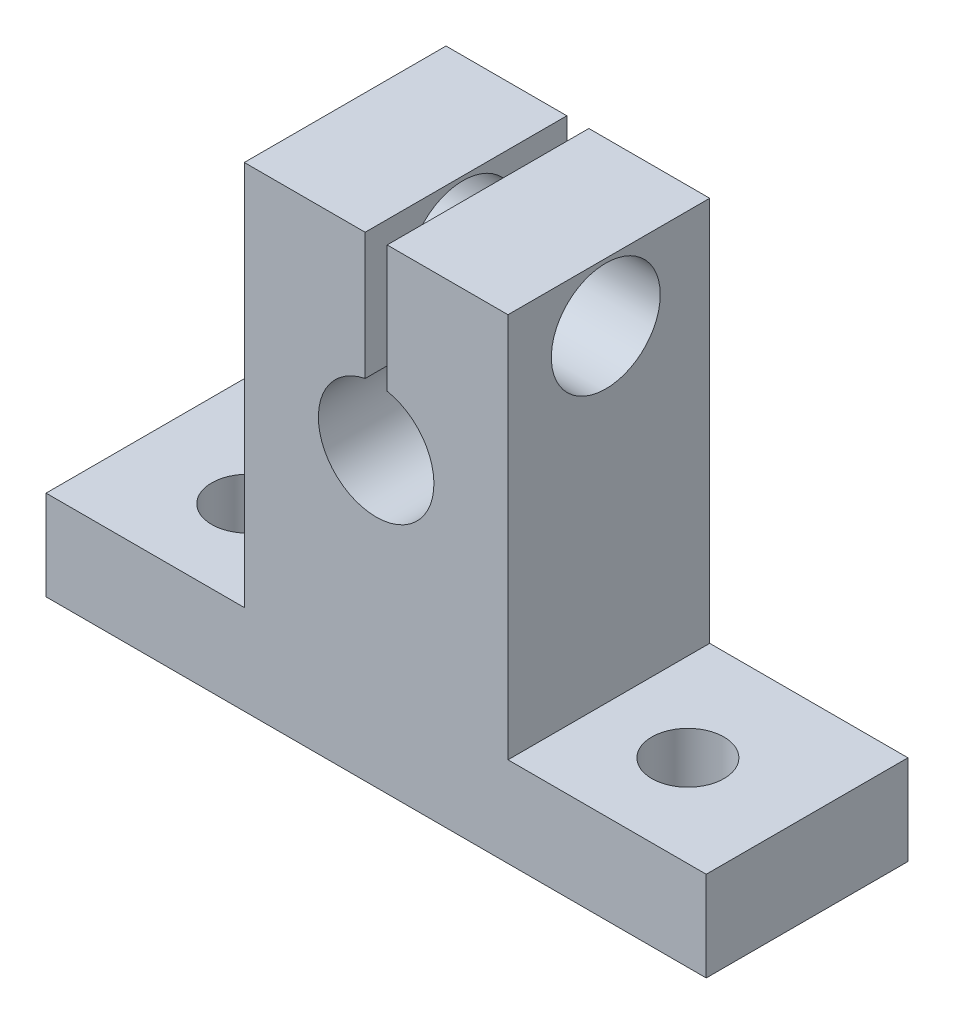
ISO-10303-21;
HEADER;
FILE_DESCRIPTION(('STEP AP214'),'2;1');
FILE_NAME('part.step','',(''),(''),'','','');
FILE_SCHEMA(('AUTOMOTIVE_DESIGN { 1 0 10303 214 1 1 1 1 }'));
ENDSEC;
DATA;
#1=APPLICATION_CONTEXT('core data for automotive mechanical design processes');
#2=APPLICATION_PROTOCOL_DEFINITION('international standard','automotive_design',2000,#1);
#3=PRODUCT_CONTEXT('',#1,'mechanical');
#4=PRODUCT('Part','Part','',(#3));
#5=PRODUCT_RELATED_PRODUCT_CATEGORY('part','',(#4));
#6=PRODUCT_DEFINITION_FORMATION('','',#4);
#7=PRODUCT_DEFINITION_CONTEXT('part definition',#1,'design');
#8=PRODUCT_DEFINITION('design','',#6,#7);
#9=PRODUCT_DEFINITION_SHAPE('','',#8);
#10=(LENGTH_UNIT() NAMED_UNIT(*) SI_UNIT(.MILLI.,.METRE.));
#11=(NAMED_UNIT(*) PLANE_ANGLE_UNIT() SI_UNIT($,.RADIAN.));
#12=(NAMED_UNIT(*) SI_UNIT($,.STERADIAN.) SOLID_ANGLE_UNIT());
#13=UNCERTAINTY_MEASURE_WITH_UNIT(LENGTH_MEASURE(1.E-05),#10,'distance_accuracy_value','');
#14=(GEOMETRIC_REPRESENTATION_CONTEXT(3) GLOBAL_UNCERTAINTY_ASSIGNED_CONTEXT((#13)) GLOBAL_UNIT_ASSIGNED_CONTEXT((#10,
#11,#12)) REPRESENTATION_CONTEXT('',''));
#15=CARTESIAN_POINT('',(0.,0.,0.));
#16=DIRECTION('',(0.,0.,1.));
#17=DIRECTION('',(1.,0.,0.));
#18=AXIS2_PLACEMENT_3D('',#15,#16,#17);
#19=CARTESIAN_POINT('',(-9.1313,16.4592,13.97));
#20=DIRECTION('',(0.,-1.,0.));
#21=DIRECTION('',(0.,0.,-1.));
#22=AXIS2_PLACEMENT_3D('',#19,#20,#21);
#23=PLANE('',#22);
#24=DIRECTION('',(-1.,0.,0.));
#25=VECTOR('',#24,1.);
#26=CARTESIAN_POINT('',(-9.1313,16.4592,0.));
#27=LINE('',#26,#25);
#28=CARTESIAN_POINT('',(9.1313,16.4592,0.));
#29=VERTEX_POINT('',#28);
#30=CARTESIAN_POINT('',(0.762000000000001,16.4592,0.));
#31=VERTEX_POINT('',#30);
#32=EDGE_CURVE('E195',#29,#31,#27,.T.);
#33=ORIENTED_EDGE('',*,*,#32,.T.);
#34=DIRECTION('',(0.,0.,1.));
#35=VECTOR('',#34,1.);
#36=CARTESIAN_POINT('',(0.762000000000001,16.4592,13.97));
#37=LINE('',#36,#35);
#38=CARTESIAN_POINT('',(0.762000000000001,16.4592,13.97));
#39=VERTEX_POINT('',#38);
#40=EDGE_CURVE('E146',#31,#39,#37,.T.);
#41=ORIENTED_EDGE('',*,*,#40,.T.);
#42=DIRECTION('',(-1.,0.,0.));
#43=VECTOR('',#42,1.);
#44=CARTESIAN_POINT('',(-9.1313,16.4592,13.97));
#45=LINE('',#44,#43);
#46=CARTESIAN_POINT('',(9.1313,16.4592,13.97));
#47=VERTEX_POINT('',#46);
#48=EDGE_CURVE('E136',#47,#39,#45,.T.);
#49=ORIENTED_EDGE('',*,*,#48,.F.);
#50=DIRECTION('',(0.,0.,-1.));
#51=VECTOR('',#50,1.);
#52=CARTESIAN_POINT('',(9.1313,16.4592,13.97));
#53=LINE('',#52,#51);
#54=EDGE_CURVE('E204',#47,#29,#53,.T.);
#55=ORIENTED_EDGE('',*,*,#54,.T.);
#56=EDGE_LOOP('',(#33,#41,#49,#55));
#57=FACE_BOUND('',#56,.T.);
#58=ADVANCED_FACE('F36',(#57),#23,.F.);
#59=CARTESIAN_POINT('',(9.1313,-16.4592,13.97));
#60=DIRECTION('',(-1.,0.,0.));
#61=DIRECTION('',(0.,0.,1.));
#62=AXIS2_PLACEMENT_3D('',#59,#60,#61);
#63=PLANE('',#62);
#64=CARTESIAN_POINT('',(9.1313,12.3952,7.19682058690907));
#65=DIRECTION('',(1.,0.,0.));
#66=DIRECTION('',(0.,0.,-1.));
#67=AXIS2_PLACEMENT_3D('',#64,#65,#66);
#68=CIRCLE('',#67,3.7719);
#69=CARTESIAN_POINT('',(9.1313,12.3952,3.42492058690907));
#70=VERTEX_POINT('',#69);
#71=EDGE_CURVE('E425',#70,#70,#68,.T.);
#72=ORIENTED_EDGE('',*,*,#71,.F.);
#73=EDGE_LOOP('',(#72));
#74=FACE_BOUND('',#73,.T.);
#75=DIRECTION('',(0.,1.,0.));
#76=VECTOR('',#75,1.);
#77=CARTESIAN_POINT('',(9.1313,-16.4592,13.97));
#78=LINE('',#77,#76);
#79=CARTESIAN_POINT('',(9.1313,-10.2362,13.97));
#80=VERTEX_POINT('',#79);
#81=EDGE_CURVE('E182',#80,#47,#78,.T.);
#82=ORIENTED_EDGE('',*,*,#81,.F.);
#83=DIRECTION('',(0.,0.,-1.));
#84=VECTOR('',#83,1.);
#85=CARTESIAN_POINT('',(9.1313,-10.2362,13.97));
#86=LINE('',#85,#84);
#87=CARTESIAN_POINT('',(9.13129999999999,-10.2362,0.));
#88=VERTEX_POINT('',#87);
#89=EDGE_CURVE('E178',#80,#88,#86,.T.);
#90=ORIENTED_EDGE('',*,*,#89,.T.);
#91=DIRECTION('',(0.,1.,0.));
#92=VECTOR('',#91,1.);
#93=CARTESIAN_POINT('',(9.1313,-16.4592,0.));
#94=LINE('',#93,#92);
#95=EDGE_CURVE('E181',#88,#29,#94,.T.);
#96=ORIENTED_EDGE('',*,*,#95,.T.);
#97=ORIENTED_EDGE('',*,*,#54,.F.);
#98=EDGE_LOOP('',(#82,#90,#96,#97));
#99=FACE_BOUND('',#98,.T.);
#100=ADVANCED_FACE('F38',(#74,#99),#63,.F.);
#101=CARTESIAN_POINT('',(-0.761999999999999,16.4592,13.97));
#102=VERTEX_POINT('',#101);
#103=CARTESIAN_POINT('',(-9.1313,16.4592,13.97));
#104=VERTEX_POINT('',#103);
#105=EDGE_CURVE('E184',#102,#104,#45,.T.);
#106=ORIENTED_EDGE('',*,*,#105,.F.);
#107=DIRECTION('',(0.,0.,-1.));
#108=VECTOR('',#107,1.);
#109=CARTESIAN_POINT('',(-0.761999999999999,16.4592,13.97));
#110=LINE('',#109,#108);
#111=CARTESIAN_POINT('',(-0.761999999999999,16.4592,0.));
#112=VERTEX_POINT('',#111);
#113=EDGE_CURVE('E220',#102,#112,#110,.T.);
#114=ORIENTED_EDGE('',*,*,#113,.T.);
#115=CARTESIAN_POINT('',(-9.1313,16.4592,0.));
#116=VERTEX_POINT('',#115);
#117=EDGE_CURVE('E194',#112,#116,#27,.T.);
#118=ORIENTED_EDGE('',*,*,#117,.T.);
#119=DIRECTION('',(0.,0.,-1.));
#120=VECTOR('',#119,1.);
#121=CARTESIAN_POINT('',(-9.1313,16.4592,13.97));
#122=LINE('',#121,#120);
#123=EDGE_CURVE('E192',#104,#116,#122,.T.);
#124=ORIENTED_EDGE('',*,*,#123,.F.);
#125=EDGE_LOOP('',(#106,#114,#118,#124));
#126=FACE_BOUND('',#125,.T.);
#127=ADVANCED_FACE('F230',(#126),#23,.F.);
#128=CARTESIAN_POINT('',(-9.1313,-16.4592,13.97));
#129=DIRECTION('',(1.,0.,0.));
#130=DIRECTION('',(0.,0.,-1.));
#131=AXIS2_PLACEMENT_3D('',#128,#129,#130);
#132=PLANE('',#131);
#133=CARTESIAN_POINT('',(-9.1313,12.3952,7.19682058690907));
#134=DIRECTION('',(1.,0.,0.));
#135=DIRECTION('',(0.,0.,-1.));
#136=AXIS2_PLACEMENT_3D('',#133,#134,#135);
#137=CIRCLE('',#136,3.7719);
#138=CARTESIAN_POINT('',(-9.1313,12.3952,3.42492058690907));
#139=VERTEX_POINT('',#138);
#140=EDGE_CURVE('E137',#139,#139,#137,.T.);
#141=ORIENTED_EDGE('',*,*,#140,.T.);
#142=EDGE_LOOP('',(#141));
#143=FACE_BOUND('',#142,.T.);
#144=DIRECTION('',(0.,-1.,0.));
#145=VECTOR('',#144,1.);
#146=CARTESIAN_POINT('',(-9.1313,-16.4592,0.));
#147=LINE('',#146,#145);
#148=CARTESIAN_POINT('',(-9.1313,-10.2362,0.));
#149=VERTEX_POINT('',#148);
#150=EDGE_CURVE('E198',#116,#149,#147,.T.);
#151=ORIENTED_EDGE('',*,*,#150,.T.);
#152=DIRECTION('',(0.,0.,1.));
#153=VECTOR('',#152,1.);
#154=CARTESIAN_POINT('',(-9.1313,-10.2362,13.97));
#155=LINE('',#154,#153);
#156=CARTESIAN_POINT('',(-9.1313,-10.2362,13.97));
#157=VERTEX_POINT('',#156);
#158=EDGE_CURVE('E168',#149,#157,#155,.T.);
#159=ORIENTED_EDGE('',*,*,#158,.T.);
#160=DIRECTION('',(0.,-1.,0.));
#161=VECTOR('',#160,1.);
#162=CARTESIAN_POINT('',(-9.1313,-16.4592,13.97));
#163=LINE('',#162,#161);
#164=EDGE_CURVE('E187',#104,#157,#163,.T.);
#165=ORIENTED_EDGE('',*,*,#164,.F.);
#166=ORIENTED_EDGE('',*,*,#123,.T.);
#167=EDGE_LOOP('',(#151,#159,#165,#166));
#168=FACE_BOUND('',#167,.T.);
#169=ADVANCED_FACE('F236',(#143,#168),#132,.F.);
#170=CARTESIAN_POINT('',(-9.1313,-16.4592,13.97));
#171=DIRECTION('',(0.,1.,0.));
#172=DIRECTION('',(0.,0.,1.));
#173=AXIS2_PLACEMENT_3D('',#170,#171,#172);
#174=PLANE('',#173);
#175=CARTESIAN_POINT('',(-15.24,-16.4592,7.62));
#176=DIRECTION('',(0.,1.,0.));
#177=DIRECTION('',(0.,0.,1.));
#178=AXIS2_PLACEMENT_3D('',#175,#176,#177);
#179=CIRCLE('',#178,2.5);
#180=CARTESIAN_POINT('',(-15.24,-16.4592,10.12));
#181=VERTEX_POINT('',#180);
#182=EDGE_CURVE('E435',#181,#181,#179,.T.);
#183=ORIENTED_EDGE('',*,*,#182,.T.);
#184=EDGE_LOOP('',(#183));
#185=FACE_BOUND('',#184,.T.);
#186=CARTESIAN_POINT('',(15.24,-16.4592,7.62));
#187=DIRECTION('',(0.,1.,0.));
#188=DIRECTION('',(0.,0.,1.));
#189=AXIS2_PLACEMENT_3D('',#186,#187,#188);
#190=CIRCLE('',#189,2.5);
#191=CARTESIAN_POINT('',(15.24,-16.4592,10.12));
#192=VERTEX_POINT('',#191);
#193=EDGE_CURVE('E429',#192,#192,#190,.T.);
#194=ORIENTED_EDGE('',*,*,#193,.T.);
#195=EDGE_LOOP('',(#194));
#196=FACE_BOUND('',#195,.T.);
#197=DIRECTION('',(1.,0.,0.));
#198=VECTOR('',#197,1.);
#199=CARTESIAN_POINT('',(-9.1313,-16.4592,0.));
#200=LINE('',#199,#198);
#201=CARTESIAN_POINT('',(-22.86,-16.4592,0.));
#202=VERTEX_POINT('',#201);
#203=CARTESIAN_POINT('',(22.86,-16.4592,0.));
#204=VERTEX_POINT('',#203);
#205=EDGE_CURVE('E185',#202,#204,#200,.T.);
#206=ORIENTED_EDGE('',*,*,#205,.T.);
#207=DIRECTION('',(0.,0.,1.));
#208=VECTOR('',#207,1.);
#209=CARTESIAN_POINT('',(22.86,-16.4592,0.));
#210=LINE('',#209,#208);
#211=CARTESIAN_POINT('',(22.86,-16.4592,13.97));
#212=VERTEX_POINT('',#211);
#213=EDGE_CURVE('E165',#204,#212,#210,.T.);
#214=ORIENTED_EDGE('',*,*,#213,.T.);
#215=DIRECTION('',(1.,0.,0.));
#216=VECTOR('',#215,1.);
#217=CARTESIAN_POINT('',(-9.1313,-16.4592,13.97));
#218=LINE('',#217,#216);
#219=CARTESIAN_POINT('',(-22.86,-16.4592,13.97));
#220=VERTEX_POINT('',#219);
#221=EDGE_CURVE('E190',#220,#212,#218,.T.);
#222=ORIENTED_EDGE('',*,*,#221,.F.);
#223=DIRECTION('',(0.,0.,1.));
#224=VECTOR('',#223,1.);
#225=CARTESIAN_POINT('',(-22.86,-16.4592,0.));
#226=LINE('',#225,#224);
#227=EDGE_CURVE('E169',#202,#220,#226,.T.);
#228=ORIENTED_EDGE('',*,*,#227,.F.);
#229=EDGE_LOOP('',(#206,#214,#222,#228));
#230=FACE_BOUND('',#229,.T.);
#231=ADVANCED_FACE('F246',(#185,#196,#230),#174,.F.);
#232=CARTESIAN_POINT('',(0.,0.,13.97));
#233=DIRECTION('',(0.,0.,-1.));
#234=DIRECTION('',(-1.,0.,0.));
#235=AXIS2_PLACEMENT_3D('',#232,#233,#234);
#236=PLANE('',#235);
#237=ORIENTED_EDGE('',*,*,#48,.T.);
#238=DIRECTION('',(0.,1.,0.));
#239=VECTOR('',#238,1.);
#240=CARTESIAN_POINT('',(0.761999999999999,28.490431103224,13.97));
#241=LINE('',#240,#239);
#242=CARTESIAN_POINT('',(0.762000000000002,7.68645810840082,13.97));
#243=VERTEX_POINT('',#242);
#244=EDGE_CURVE('E124',#243,#39,#241,.T.);
#245=ORIENTED_EDGE('',*,*,#244,.F.);
#246=CARTESIAN_POINT('',(0.,3.7592,13.97));
#247=DIRECTION('',(0.,0.,-1.));
#248=DIRECTION('',(-1.,0.,0.));
#249=AXIS2_PLACEMENT_3D('',#246,#247,#248);
#250=CIRCLE('',#249,4.0005);
#251=CARTESIAN_POINT('',(-0.761999999999998,7.68645810840082,13.97));
#252=VERTEX_POINT('',#251);
#253=EDGE_CURVE('E134',#243,#252,#250,.T.);
#254=ORIENTED_EDGE('',*,*,#253,.T.);
#255=DIRECTION('',(0.,-1.,0.));
#256=VECTOR('',#255,1.);
#257=CARTESIAN_POINT('',(-0.762000000000001,28.490431103224,13.97));
#258=LINE('',#257,#256);
#259=EDGE_CURVE('E52',#102,#252,#258,.T.);
#260=ORIENTED_EDGE('',*,*,#259,.F.);
#261=ORIENTED_EDGE('',*,*,#105,.T.);
#262=ORIENTED_EDGE('',*,*,#164,.T.);
#263=DIRECTION('',(-1.,0.,0.));
#264=VECTOR('',#263,1.);
#265=CARTESIAN_POINT('',(-22.86,-10.2362,13.97));
#266=LINE('',#265,#264);
#267=CARTESIAN_POINT('',(-22.86,-10.2362,13.97));
#268=VERTEX_POINT('',#267);
#269=EDGE_CURVE('E144',#157,#268,#266,.T.);
#270=ORIENTED_EDGE('',*,*,#269,.T.);
#271=DIRECTION('',(0.,-1.,0.));
#272=VECTOR('',#271,1.);
#273=CARTESIAN_POINT('',(-22.86,-10.2362,13.97));
#274=LINE('',#273,#272);
#275=EDGE_CURVE('E154',#268,#220,#274,.T.);
#276=ORIENTED_EDGE('',*,*,#275,.T.);
#277=ORIENTED_EDGE('',*,*,#221,.T.);
#278=DIRECTION('',(0.,1.,0.));
#279=VECTOR('',#278,1.);
#280=CARTESIAN_POINT('',(22.86,-10.2362,13.97));
#281=LINE('',#280,#279);
#282=CARTESIAN_POINT('',(22.86,-10.2362,13.97));
#283=VERTEX_POINT('',#282);
#284=EDGE_CURVE('E140',#212,#283,#281,.T.);
#285=ORIENTED_EDGE('',*,*,#284,.T.);
#286=EDGE_CURVE('E161',#283,#80,#266,.T.);
#287=ORIENTED_EDGE('',*,*,#286,.T.);
#288=ORIENTED_EDGE('',*,*,#81,.T.);
#289=EDGE_LOOP('',(#237,#245,#254,#260,#261,#262,#270,#276,#277,#285,#287,#288));
#290=FACE_BOUND('',#289,.T.);
#291=ADVANCED_FACE('F133',(#290),#236,.F.);
#292=CARTESIAN_POINT('',(0.,0.,0.));
#293=DIRECTION('',(0.,0.,-1.));
#294=DIRECTION('',(-1.,0.,0.));
#295=AXIS2_PLACEMENT_3D('',#292,#293,#294);
#296=PLANE('',#295);
#297=DIRECTION('',(0.,1.,0.));
#298=VECTOR('',#297,1.);
#299=CARTESIAN_POINT('',(0.761999999999999,28.490431103224,0.));
#300=LINE('',#299,#298);
#301=CARTESIAN_POINT('',(0.762000000000002,7.68645810840082,0.));
#302=VERTEX_POINT('',#301);
#303=EDGE_CURVE('E60',#302,#31,#300,.T.);
#304=ORIENTED_EDGE('',*,*,#303,.T.);
#305=ORIENTED_EDGE('',*,*,#32,.F.);
#306=ORIENTED_EDGE('',*,*,#95,.F.);
#307=DIRECTION('',(-1.,0.,0.));
#308=VECTOR('',#307,1.);
#309=CARTESIAN_POINT('',(-22.86,-10.2362,0.));
#310=LINE('',#309,#308);
#311=CARTESIAN_POINT('',(22.86,-10.2362,0.));
#312=VERTEX_POINT('',#311);
#313=EDGE_CURVE('E155',#312,#88,#310,.T.);
#314=ORIENTED_EDGE('',*,*,#313,.F.);
#315=DIRECTION('',(0.,1.,0.));
#316=VECTOR('',#315,1.);
#317=CARTESIAN_POINT('',(22.86,-10.2362,0.));
#318=LINE('',#317,#316);
#319=EDGE_CURVE('E150',#204,#312,#318,.T.);
#320=ORIENTED_EDGE('',*,*,#319,.F.);
#321=ORIENTED_EDGE('',*,*,#205,.F.);
#322=DIRECTION('',(0.,-1.,0.));
#323=VECTOR('',#322,1.);
#324=CARTESIAN_POINT('',(-22.86,-10.2362,0.));
#325=LINE('',#324,#323);
#326=CARTESIAN_POINT('',(-22.86,-10.2362,0.));
#327=VERTEX_POINT('',#326);
#328=EDGE_CURVE('E157',#327,#202,#325,.T.);
#329=ORIENTED_EDGE('',*,*,#328,.F.);
#330=EDGE_CURVE('E153',#149,#327,#310,.T.);
#331=ORIENTED_EDGE('',*,*,#330,.F.);
#332=ORIENTED_EDGE('',*,*,#150,.F.);
#333=ORIENTED_EDGE('',*,*,#117,.F.);
#334=DIRECTION('',(0.,-1.,0.));
#335=VECTOR('',#334,1.);
#336=CARTESIAN_POINT('',(-0.762000000000001,28.490431103224,0.));
#337=LINE('',#336,#335);
#338=CARTESIAN_POINT('',(-0.761999999999998,7.68645810840082,0.));
#339=VERTEX_POINT('',#338);
#340=EDGE_CURVE('E218',#112,#339,#337,.T.);
#341=ORIENTED_EDGE('',*,*,#340,.T.);
#342=CARTESIAN_POINT('',(0.,3.7592,0.));
#343=DIRECTION('',(0.,0.,1.));
#344=DIRECTION('',(1.,0.,0.));
#345=AXIS2_PLACEMENT_3D('',#342,#343,#344);
#346=CIRCLE('',#345,4.0005);
#347=EDGE_CURVE('E141',#339,#302,#346,.T.);
#348=ORIENTED_EDGE('',*,*,#347,.T.);
#349=EDGE_LOOP('',(#304,#305,#306,#314,#320,#321,#329,#331,#332,#333,#341,#348));
#350=FACE_BOUND('',#349,.T.);
#351=ADVANCED_FACE('F216',(#350),#296,.T.);
#352=CARTESIAN_POINT('',(-22.86,-10.2362,0.));
#353=DIRECTION('',(-1.,0.,0.));
#354=DIRECTION('',(0.,0.,1.));
#355=AXIS2_PLACEMENT_3D('',#352,#353,#354);
#356=PLANE('',#355);
#357=ORIENTED_EDGE('',*,*,#275,.F.);
#358=DIRECTION('',(0.,0.,1.));
#359=VECTOR('',#358,1.);
#360=CARTESIAN_POINT('',(-22.86,-10.2362,0.));
#361=LINE('',#360,#359);
#362=EDGE_CURVE('E172',#327,#268,#361,.T.);
#363=ORIENTED_EDGE('',*,*,#362,.F.);
#364=ORIENTED_EDGE('',*,*,#328,.T.);
#365=ORIENTED_EDGE('',*,*,#227,.T.);
#366=EDGE_LOOP('',(#357,#363,#364,#365));
#367=FACE_BOUND('',#366,.T.);
#368=ADVANCED_FACE('F243',(#367),#356,.T.);
#369=CARTESIAN_POINT('',(-22.86,-10.2362,0.));
#370=DIRECTION('',(0.,1.,0.));
#371=DIRECTION('',(0.,0.,1.));
#372=AXIS2_PLACEMENT_3D('',#369,#370,#371);
#373=PLANE('',#372);
#374=CARTESIAN_POINT('',(-15.24,-10.2362,7.62));
#375=DIRECTION('',(0.,1.,0.));
#376=DIRECTION('',(0.,0.,1.));
#377=AXIS2_PLACEMENT_3D('',#374,#375,#376);
#378=CIRCLE('',#377,2.5);
#379=CARTESIAN_POINT('',(-15.24,-10.2362,10.12));
#380=VERTEX_POINT('',#379);
#381=EDGE_CURVE('E438',#380,#380,#378,.T.);
#382=ORIENTED_EDGE('',*,*,#381,.F.);
#383=EDGE_LOOP('',(#382));
#384=FACE_BOUND('',#383,.T.);
#385=ORIENTED_EDGE('',*,*,#158,.F.);
#386=ORIENTED_EDGE('',*,*,#330,.T.);
#387=ORIENTED_EDGE('',*,*,#362,.T.);
#388=ORIENTED_EDGE('',*,*,#269,.F.);
#389=EDGE_LOOP('',(#385,#386,#387,#388));
#390=FACE_BOUND('',#389,.T.);
#391=ADVANCED_FACE('F241',(#384,#390),#373,.T.);
#392=CARTESIAN_POINT('',(15.24,-10.2362,7.62));
#393=DIRECTION('',(0.,1.,0.));
#394=DIRECTION('',(0.,0.,1.));
#395=AXIS2_PLACEMENT_3D('',#392,#393,#394);
#396=CIRCLE('',#395,2.5);
#397=CARTESIAN_POINT('',(15.24,-10.2362,10.12));
#398=VERTEX_POINT('',#397);
#399=EDGE_CURVE('E432',#398,#398,#396,.T.);
#400=ORIENTED_EDGE('',*,*,#399,.F.);
#401=EDGE_LOOP('',(#400));
#402=FACE_BOUND('',#401,.T.);
#403=ORIENTED_EDGE('',*,*,#89,.F.);
#404=ORIENTED_EDGE('',*,*,#286,.F.);
#405=DIRECTION('',(0.,0.,1.));
#406=VECTOR('',#405,1.);
#407=CARTESIAN_POINT('',(22.86,-10.2362,0.));
#408=LINE('',#407,#406);
#409=EDGE_CURVE('E159',#312,#283,#408,.T.);
#410=ORIENTED_EDGE('',*,*,#409,.F.);
#411=ORIENTED_EDGE('',*,*,#313,.T.);
#412=EDGE_LOOP('',(#403,#404,#410,#411));
#413=FACE_BOUND('',#412,.T.);
#414=ADVANCED_FACE('F254',(#402,#413),#373,.T.);
#415=CARTESIAN_POINT('',(22.86,-10.2362,0.));
#416=DIRECTION('',(1.,0.,0.));
#417=DIRECTION('',(0.,0.,-1.));
#418=AXIS2_PLACEMENT_3D('',#415,#416,#417);
#419=PLANE('',#418);
#420=ORIENTED_EDGE('',*,*,#284,.F.);
#421=ORIENTED_EDGE('',*,*,#213,.F.);
#422=ORIENTED_EDGE('',*,*,#319,.T.);
#423=ORIENTED_EDGE('',*,*,#409,.T.);
#424=EDGE_LOOP('',(#420,#421,#422,#423));
#425=FACE_BOUND('',#424,.T.);
#426=ADVANCED_FACE('F251',(#425),#419,.T.);
#427=CARTESIAN_POINT('',(0.,3.7592,0.));
#428=DIRECTION('',(0.,0.,1.));
#429=DIRECTION('',(1.,0.,0.));
#430=AXIS2_PLACEMENT_3D('',#427,#428,#429);
#431=CYLINDRICAL_SURFACE('',#430,4.0005);
#432=ORIENTED_EDGE('',*,*,#253,.F.);
#433=DIRECTION('',(0.,0.,1.));
#434=VECTOR('',#433,1.);
#435=CARTESIAN_POINT('',(0.762000000000002,7.68645810840082,0.));
#436=LINE('',#435,#434);
#437=EDGE_CURVE('E11',#243,#302,#436,.F.);
#438=ORIENTED_EDGE('',*,*,#437,.T.);
#439=ORIENTED_EDGE('',*,*,#347,.F.);
#440=DIRECTION('',(0.,0.,1.));
#441=VECTOR('',#440,1.);
#442=CARTESIAN_POINT('',(-0.761999999999998,7.68645810840082,0.));
#443=LINE('',#442,#441);
#444=EDGE_CURVE('E45',#339,#252,#443,.T.);
#445=ORIENTED_EDGE('',*,*,#444,.T.);
#446=EDGE_LOOP('',(#432,#438,#439,#445));
#447=FACE_BOUND('',#446,.T.);
#448=ADVANCED_FACE('F139',(#447),#431,.F.);
#449=CARTESIAN_POINT('',(-0.762000000000001,28.490431103224,0.));
#450=DIRECTION('',(-1.,0.,0.));
#451=DIRECTION('',(0.,-1.,0.));
#452=AXIS2_PLACEMENT_3D('',#449,#450,#451);
#453=PLANE('',#452);
#454=CARTESIAN_POINT('',(-0.761999999999999,12.3952,7.19682058690907));
#455=DIRECTION('',(-1.,0.,0.));
#456=DIRECTION('',(0.,-1.,0.));
#457=AXIS2_PLACEMENT_3D('',#454,#455,#456);
#458=CIRCLE('',#457,3.7719);
#459=CARTESIAN_POINT('',(-0.761999999999998,8.6233,7.19682058690907));
#460=VERTEX_POINT('',#459);
#461=EDGE_CURVE('E423',#460,#460,#458,.T.);
#462=ORIENTED_EDGE('',*,*,#461,.T.);
#463=EDGE_LOOP('',(#462));
#464=FACE_BOUND('',#463,.T.);
#465=ORIENTED_EDGE('',*,*,#259,.T.);
#466=ORIENTED_EDGE('',*,*,#444,.F.);
#467=ORIENTED_EDGE('',*,*,#340,.F.);
#468=ORIENTED_EDGE('',*,*,#113,.F.);
#469=EDGE_LOOP('',(#465,#466,#467,#468));
#470=FACE_BOUND('',#469,.T.);
#471=ADVANCED_FACE('F350',(#464,#470),#453,.F.);
#472=CARTESIAN_POINT('',(0.761999999999999,28.490431103224,0.));
#473=DIRECTION('',(1.,0.,0.));
#474=DIRECTION('',(0.,1.,0.));
#475=AXIS2_PLACEMENT_3D('',#472,#473,#474);
#476=PLANE('',#475);
#477=CARTESIAN_POINT('',(0.762000000000002,12.3952,7.19682058690907));
#478=DIRECTION('',(1.,0.,0.));
#479=DIRECTION('',(0.,1.,0.));
#480=AXIS2_PLACEMENT_3D('',#477,#478,#479);
#481=CIRCLE('',#480,3.7719);
#482=CARTESIAN_POINT('',(0.762000000000002,16.1671,7.19682058690907));
#483=VERTEX_POINT('',#482);
#484=EDGE_CURVE('E40',#483,#483,#481,.T.);
#485=ORIENTED_EDGE('',*,*,#484,.T.);
#486=EDGE_LOOP('',(#485));
#487=FACE_BOUND('',#486,.T.);
#488=ORIENTED_EDGE('',*,*,#303,.F.);
#489=ORIENTED_EDGE('',*,*,#437,.F.);
#490=ORIENTED_EDGE('',*,*,#244,.T.);
#491=ORIENTED_EDGE('',*,*,#40,.F.);
#492=EDGE_LOOP('',(#488,#489,#490,#491));
#493=FACE_BOUND('',#492,.T.);
#494=ADVANCED_FACE('F123',(#487,#493),#476,.F.);
#495=CARTESIAN_POINT('',(-22.86,12.3952,7.19682058690907));
#496=DIRECTION('',(1.,0.,0.));
#497=DIRECTION('',(0.,0.,-1.));
#498=AXIS2_PLACEMENT_3D('',#495,#496,#497);
#499=CYLINDRICAL_SURFACE('',#498,3.7719);
#500=ORIENTED_EDGE('',*,*,#71,.T.);
#501=EDGE_LOOP('',(#500));
#502=FACE_BOUND('',#501,.T.);
#503=ORIENTED_EDGE('',*,*,#484,.F.);
#504=EDGE_LOOP('',(#503));
#505=FACE_BOUND('',#504,.T.);
#506=ADVANCED_FACE('F336',(#502,#505),#499,.F.);
#507=ORIENTED_EDGE('',*,*,#461,.F.);
#508=EDGE_LOOP('',(#507));
#509=FACE_BOUND('',#508,.T.);
#510=ORIENTED_EDGE('',*,*,#140,.F.);
#511=EDGE_LOOP('',(#510));
#512=FACE_BOUND('',#511,.T.);
#513=ADVANCED_FACE('F329',(#509,#512),#499,.F.);
#514=CARTESIAN_POINT('',(15.24,-10.2362,7.62));
#515=DIRECTION('',(0.,1.,0.));
#516=DIRECTION('',(0.,0.,1.));
#517=AXIS2_PLACEMENT_3D('',#514,#515,#516);
#518=CYLINDRICAL_SURFACE('',#517,2.5);
#519=ORIENTED_EDGE('',*,*,#193,.F.);
#520=EDGE_LOOP('',(#519));
#521=FACE_BOUND('',#520,.T.);
#522=ORIENTED_EDGE('',*,*,#399,.T.);
#523=EDGE_LOOP('',(#522));
#524=FACE_BOUND('',#523,.T.);
#525=ADVANCED_FACE('F319',(#521,#524),#518,.F.);
#526=CARTESIAN_POINT('',(-15.24,-10.2362,7.62));
#527=DIRECTION('',(0.,1.,0.));
#528=DIRECTION('',(0.,0.,1.));
#529=AXIS2_PLACEMENT_3D('',#526,#527,#528);
#530=CYLINDRICAL_SURFACE('',#529,2.5);
#531=ORIENTED_EDGE('',*,*,#182,.F.);
#532=EDGE_LOOP('',(#531));
#533=FACE_BOUND('',#532,.T.);
#534=ORIENTED_EDGE('',*,*,#381,.T.);
#535=EDGE_LOOP('',(#534));
#536=FACE_BOUND('',#535,.T.);
#537=ADVANCED_FACE('F315',(#533,#536),#530,.F.);
#538=CLOSED_SHELL('',(#58,#100,#127,#169,#231,#291,#351,#368,#391,#414,#426,#448,#471,#494,#506,
#513,#525,#537));
#539=MANIFOLD_SOLID_BREP('B2',#538);
#540=ADVANCED_BREP_SHAPE_REPRESENTATION('',(#18,#539),#14);
#541=SHAPE_DEFINITION_REPRESENTATION(#9,#540);
ENDSEC;
END-ISO-10303-21;
